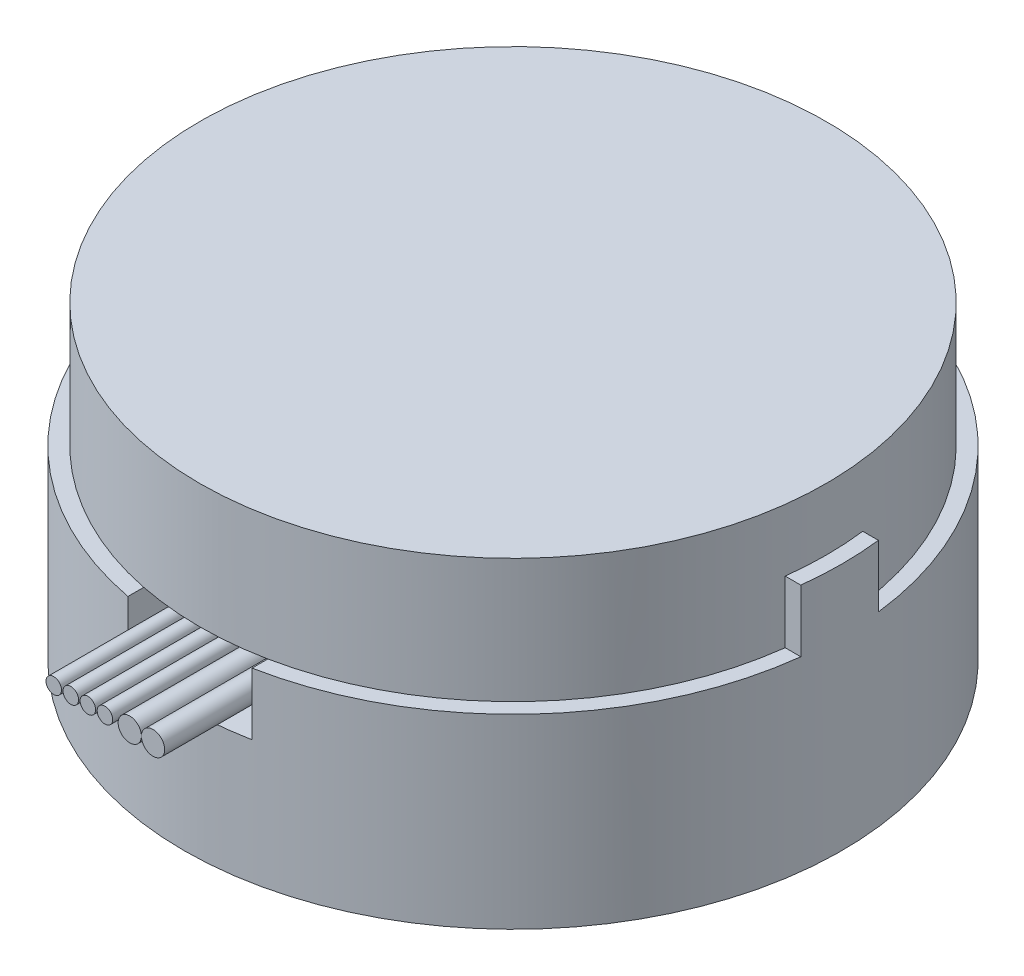
ISO-10303-21;
HEADER;
FILE_DESCRIPTION(('STEP AP214'),'2;1');
FILE_NAME('part.step','',(''),(''),'','','');
FILE_SCHEMA(('AUTOMOTIVE_DESIGN { 1 0 10303 214 1 1 1 1 }'));
ENDSEC;
DATA;
#1=APPLICATION_CONTEXT('core data for automotive mechanical design processes');
#2=APPLICATION_PROTOCOL_DEFINITION('international standard','automotive_design',2000,#1);
#3=PRODUCT_CONTEXT('',#1,'mechanical');
#4=PRODUCT('Part','Part','',(#3));
#5=PRODUCT_RELATED_PRODUCT_CATEGORY('part','',(#4));
#6=PRODUCT_DEFINITION_FORMATION('','',#4);
#7=PRODUCT_DEFINITION_CONTEXT('part definition',#1,'design');
#8=PRODUCT_DEFINITION('design','',#6,#7);
#9=PRODUCT_DEFINITION_SHAPE('','',#8);
#10=(LENGTH_UNIT() NAMED_UNIT(*) SI_UNIT(.MILLI.,.METRE.));
#11=(NAMED_UNIT(*) PLANE_ANGLE_UNIT() SI_UNIT($,.RADIAN.));
#12=(NAMED_UNIT(*) SI_UNIT($,.STERADIAN.) SOLID_ANGLE_UNIT());
#13=UNCERTAINTY_MEASURE_WITH_UNIT(LENGTH_MEASURE(1.E-05),#10,'distance_accuracy_value','');
#14=(GEOMETRIC_REPRESENTATION_CONTEXT(3) GLOBAL_UNCERTAINTY_ASSIGNED_CONTEXT((#13)) GLOBAL_UNIT_ASSIGNED_CONTEXT((#10,
#11,#12)) REPRESENTATION_CONTEXT('',''));
#15=CARTESIAN_POINT('',(0.,0.,0.));
#16=DIRECTION('',(0.,0.,1.));
#17=DIRECTION('',(1.,0.,0.));
#18=AXIS2_PLACEMENT_3D('',#15,#16,#17);
#19=CARTESIAN_POINT('',(1.5,10.0171345321893,26.2));
#20=DIRECTION('',(0.,0.,-1.));
#21=DIRECTION('',(-1.,0.,0.));
#22=AXIS2_PLACEMENT_3D('',#19,#20,#21);
#23=CYLINDRICAL_SURFACE('',#22,0.75);
#24=CARTESIAN_POINT('',(1.5,10.0171345321893,16.2));
#25=DIRECTION('',(0.,0.,1.));
#26=DIRECTION('',(1.,0.,0.));
#27=AXIS2_PLACEMENT_3D('',#24,#25,#26);
#28=CIRCLE('',#27,0.75);
#29=CARTESIAN_POINT('',(2.25,10.0171345321893,16.2));
#30=VERTEX_POINT('',#29);
#31=EDGE_CURVE('E65',#30,#30,#28,.T.);
#32=ORIENTED_EDGE('',*,*,#31,.T.);
#33=EDGE_LOOP('',(#32));
#34=FACE_BOUND('',#33,.T.);
#35=CARTESIAN_POINT('',(1.5,10.0171345321893,26.2));
#36=DIRECTION('',(0.,0.,1.));
#37=DIRECTION('',(1.,0.,0.));
#38=AXIS2_PLACEMENT_3D('',#35,#36,#37);
#39=CIRCLE('',#38,0.75);
#40=CARTESIAN_POINT('',(2.25,10.0171345321893,26.2));
#41=VERTEX_POINT('',#40);
#42=EDGE_CURVE('E13',#41,#41,#39,.T.);
#43=ORIENTED_EDGE('',*,*,#42,.F.);
#44=EDGE_LOOP('',(#43));
#45=FACE_BOUND('',#44,.T.);
#46=ADVANCED_FACE('F62',(#34,#45),#23,.T.);
#47=CARTESIAN_POINT('',(1.5,10.0171345321893,26.2));
#48=DIRECTION('',(0.,0.,1.));
#49=DIRECTION('',(1.,0.,0.));
#50=AXIS2_PLACEMENT_3D('',#47,#48,#49);
#51=PLANE('',#50);
#52=ORIENTED_EDGE('',*,*,#42,.T.);
#53=EDGE_LOOP('',(#52));
#54=FACE_BOUND('',#53,.T.);
#55=ADVANCED_FACE('F78',(#54),#51,.T.);
#56=CARTESIAN_POINT('',(1.5,10.0171345321893,16.2));
#57=DIRECTION('',(0.,0.,1.));
#58=DIRECTION('',(1.,0.,0.));
#59=AXIS2_PLACEMENT_3D('',#56,#57,#58);
#60=PLANE('',#59);
#61=ORIENTED_EDGE('',*,*,#31,.F.);
#62=EDGE_LOOP('',(#61));
#63=FACE_BOUND('',#62,.T.);
#64=ADVANCED_FACE('F76',(#63),#60,.F.);
#65=CLOSED_SHELL('',(#46,#55,#64));
#66=MANIFOLD_SOLID_BREP('B2',#65);
#67=CARTESIAN_POINT('',(3.,10.0171345321893,26.2));
#68=DIRECTION('',(0.,0.,-1.));
#69=DIRECTION('',(-1.,0.,0.));
#70=AXIS2_PLACEMENT_3D('',#67,#68,#69);
#71=CYLINDRICAL_SURFACE('',#70,0.75);
#72=CARTESIAN_POINT('',(3.,10.0171345321893,16.2));
#73=DIRECTION('',(0.,0.,1.));
#74=DIRECTION('',(1.,0.,0.));
#75=AXIS2_PLACEMENT_3D('',#72,#73,#74);
#76=CIRCLE('',#75,0.75);
#77=CARTESIAN_POINT('',(3.75,10.0171345321893,16.2));
#78=VERTEX_POINT('',#77);
#79=EDGE_CURVE('E61',#78,#78,#76,.T.);
#80=ORIENTED_EDGE('',*,*,#79,.T.);
#81=EDGE_LOOP('',(#80));
#82=FACE_BOUND('',#81,.T.);
#83=CARTESIAN_POINT('',(3.,10.0171345321893,26.2));
#84=DIRECTION('',(0.,0.,1.));
#85=DIRECTION('',(1.,0.,0.));
#86=AXIS2_PLACEMENT_3D('',#83,#84,#85);
#87=CIRCLE('',#86,0.75);
#88=CARTESIAN_POINT('',(3.75,10.0171345321893,26.2));
#89=VERTEX_POINT('',#88);
#90=EDGE_CURVE('E114',#89,#89,#87,.T.);
#91=ORIENTED_EDGE('',*,*,#90,.F.);
#92=EDGE_LOOP('',(#91));
#93=FACE_BOUND('',#92,.T.);
#94=ADVANCED_FACE('F110',(#82,#93),#71,.T.);
#95=CARTESIAN_POINT('',(3.,10.0171345321893,26.2));
#96=DIRECTION('',(0.,0.,1.));
#97=DIRECTION('',(1.,0.,0.));
#98=AXIS2_PLACEMENT_3D('',#95,#96,#97);
#99=PLANE('',#98);
#100=ORIENTED_EDGE('',*,*,#90,.T.);
#101=EDGE_LOOP('',(#100));
#102=FACE_BOUND('',#101,.T.);
#103=ADVANCED_FACE('F112',(#102),#99,.T.);
#104=CARTESIAN_POINT('',(3.,10.0171345321893,16.2));
#105=DIRECTION('',(0.,0.,1.));
#106=DIRECTION('',(1.,0.,0.));
#107=AXIS2_PLACEMENT_3D('',#104,#105,#106);
#108=PLANE('',#107);
#109=ORIENTED_EDGE('',*,*,#79,.F.);
#110=EDGE_LOOP('',(#109));
#111=FACE_BOUND('',#110,.T.);
#112=ADVANCED_FACE('F129',(#111),#108,.F.);
#113=CLOSED_SHELL('',(#94,#103,#112));
#114=MANIFOLD_SOLID_BREP('B8',#113);
#115=CARTESIAN_POINT('',(-0.1,10.0171345321893,26.2));
#116=DIRECTION('',(0.,0.,-1.));
#117=DIRECTION('',(-1.,0.,0.));
#118=AXIS2_PLACEMENT_3D('',#115,#116,#117);
#119=CYLINDRICAL_SURFACE('',#118,0.5);
#120=CARTESIAN_POINT('',(-0.1,10.0171345321893,26.2));
#121=DIRECTION('',(0.,0.,1.));
#122=DIRECTION('',(1.,0.,0.));
#123=AXIS2_PLACEMENT_3D('',#120,#121,#122);
#124=CIRCLE('',#123,0.5);
#125=CARTESIAN_POINT('',(0.4,10.0171345321893,26.2));
#126=VERTEX_POINT('',#125);
#127=EDGE_CURVE('E162',#126,#126,#124,.T.);
#128=ORIENTED_EDGE('',*,*,#127,.F.);
#129=EDGE_LOOP('',(#128));
#130=FACE_BOUND('',#129,.T.);
#131=CARTESIAN_POINT('',(-0.1,10.0171345321893,16.2));
#132=DIRECTION('',(0.,0.,1.));
#133=DIRECTION('',(1.,0.,0.));
#134=AXIS2_PLACEMENT_3D('',#131,#132,#133);
#135=CIRCLE('',#134,0.5);
#136=CARTESIAN_POINT('',(0.4,10.0171345321893,16.2));
#137=VERTEX_POINT('',#136);
#138=EDGE_CURVE('E109',#137,#137,#135,.T.);
#139=ORIENTED_EDGE('',*,*,#138,.T.);
#140=EDGE_LOOP('',(#139));
#141=FACE_BOUND('',#140,.T.);
#142=ADVANCED_FACE('F158',(#130,#141),#119,.T.);
#143=CARTESIAN_POINT('',(-0.1,10.0171345321893,26.2));
#144=DIRECTION('',(0.,0.,1.));
#145=DIRECTION('',(1.,0.,0.));
#146=AXIS2_PLACEMENT_3D('',#143,#144,#145);
#147=PLANE('',#146);
#148=ORIENTED_EDGE('',*,*,#127,.T.);
#149=EDGE_LOOP('',(#148));
#150=FACE_BOUND('',#149,.T.);
#151=ADVANCED_FACE('F160',(#150),#147,.T.);
#152=CARTESIAN_POINT('',(-0.1,10.0171345321893,16.2));
#153=DIRECTION('',(0.,0.,1.));
#154=DIRECTION('',(1.,0.,0.));
#155=AXIS2_PLACEMENT_3D('',#152,#153,#154);
#156=PLANE('',#155);
#157=ORIENTED_EDGE('',*,*,#138,.F.);
#158=EDGE_LOOP('',(#157));
#159=FACE_BOUND('',#158,.T.);
#160=ADVANCED_FACE('F177',(#159),#156,.F.);
#161=CLOSED_SHELL('',(#142,#151,#160));
#162=MANIFOLD_SOLID_BREP('B56',#161);
#163=CARTESIAN_POINT('',(-1.2,10.0171345321893,26.2));
#164=DIRECTION('',(0.,0.,-1.));
#165=DIRECTION('',(-1.,0.,0.));
#166=AXIS2_PLACEMENT_3D('',#163,#164,#165);
#167=CYLINDRICAL_SURFACE('',#166,0.5);
#168=CARTESIAN_POINT('',(-1.2,10.0171345321893,26.2));
#169=DIRECTION('',(0.,0.,1.));
#170=DIRECTION('',(1.,0.,0.));
#171=AXIS2_PLACEMENT_3D('',#168,#169,#170);
#172=CIRCLE('',#171,0.5);
#173=CARTESIAN_POINT('',(-0.7,10.0171345321893,26.2));
#174=VERTEX_POINT('',#173);
#175=EDGE_CURVE('E210',#174,#174,#172,.T.);
#176=ORIENTED_EDGE('',*,*,#175,.F.);
#177=EDGE_LOOP('',(#176));
#178=FACE_BOUND('',#177,.T.);
#179=CARTESIAN_POINT('',(-1.2,10.0171345321893,16.2));
#180=DIRECTION('',(0.,0.,1.));
#181=DIRECTION('',(1.,0.,0.));
#182=AXIS2_PLACEMENT_3D('',#179,#180,#181);
#183=CIRCLE('',#182,0.5);
#184=CARTESIAN_POINT('',(-0.7,10.0171345321893,16.2));
#185=VERTEX_POINT('',#184);
#186=EDGE_CURVE('E157',#185,#185,#183,.T.);
#187=ORIENTED_EDGE('',*,*,#186,.T.);
#188=EDGE_LOOP('',(#187));
#189=FACE_BOUND('',#188,.T.);
#190=ADVANCED_FACE('F206',(#178,#189),#167,.T.);
#191=CARTESIAN_POINT('',(-1.2,10.0171345321893,26.2));
#192=DIRECTION('',(0.,0.,1.));
#193=DIRECTION('',(1.,0.,0.));
#194=AXIS2_PLACEMENT_3D('',#191,#192,#193);
#195=PLANE('',#194);
#196=ORIENTED_EDGE('',*,*,#175,.T.);
#197=EDGE_LOOP('',(#196));
#198=FACE_BOUND('',#197,.T.);
#199=ADVANCED_FACE('F208',(#198),#195,.T.);
#200=CARTESIAN_POINT('',(-1.2,10.0171345321893,16.2));
#201=DIRECTION('',(0.,0.,1.));
#202=DIRECTION('',(1.,0.,0.));
#203=AXIS2_PLACEMENT_3D('',#200,#201,#202);
#204=PLANE('',#203);
#205=ORIENTED_EDGE('',*,*,#186,.F.);
#206=EDGE_LOOP('',(#205));
#207=FACE_BOUND('',#206,.T.);
#208=ADVANCED_FACE('F225',(#207),#204,.F.);
#209=CLOSED_SHELL('',(#190,#199,#208));
#210=MANIFOLD_SOLID_BREP('B104',#209);
#211=CARTESIAN_POINT('',(-2.3,10.0171345321893,26.2));
#212=DIRECTION('',(0.,0.,-1.));
#213=DIRECTION('',(-1.,0.,0.));
#214=AXIS2_PLACEMENT_3D('',#211,#212,#213);
#215=CYLINDRICAL_SURFACE('',#214,0.5);
#216=CARTESIAN_POINT('',(-2.3,10.0171345321893,26.2));
#217=DIRECTION('',(0.,0.,1.));
#218=DIRECTION('',(1.,0.,0.));
#219=AXIS2_PLACEMENT_3D('',#216,#217,#218);
#220=CIRCLE('',#219,0.5);
#221=CARTESIAN_POINT('',(-1.8,10.0171345321893,26.2));
#222=VERTEX_POINT('',#221);
#223=EDGE_CURVE('E258',#222,#222,#220,.T.);
#224=ORIENTED_EDGE('',*,*,#223,.F.);
#225=EDGE_LOOP('',(#224));
#226=FACE_BOUND('',#225,.T.);
#227=CARTESIAN_POINT('',(-2.3,10.0171345321893,16.2));
#228=DIRECTION('',(0.,0.,1.));
#229=DIRECTION('',(1.,0.,0.));
#230=AXIS2_PLACEMENT_3D('',#227,#228,#229);
#231=CIRCLE('',#230,0.5);
#232=CARTESIAN_POINT('',(-1.8,10.0171345321893,16.2));
#233=VERTEX_POINT('',#232);
#234=EDGE_CURVE('E205',#233,#233,#231,.T.);
#235=ORIENTED_EDGE('',*,*,#234,.T.);
#236=EDGE_LOOP('',(#235));
#237=FACE_BOUND('',#236,.T.);
#238=ADVANCED_FACE('F254',(#226,#237),#215,.T.);
#239=CARTESIAN_POINT('',(-2.3,10.0171345321893,26.2));
#240=DIRECTION('',(0.,0.,1.));
#241=DIRECTION('',(1.,0.,0.));
#242=AXIS2_PLACEMENT_3D('',#239,#240,#241);
#243=PLANE('',#242);
#244=ORIENTED_EDGE('',*,*,#223,.T.);
#245=EDGE_LOOP('',(#244));
#246=FACE_BOUND('',#245,.T.);
#247=ADVANCED_FACE('F256',(#246),#243,.T.);
#248=CARTESIAN_POINT('',(-2.3,10.0171345321893,16.2));
#249=DIRECTION('',(0.,0.,1.));
#250=DIRECTION('',(1.,0.,0.));
#251=AXIS2_PLACEMENT_3D('',#248,#249,#250);
#252=PLANE('',#251);
#253=ORIENTED_EDGE('',*,*,#234,.F.);
#254=EDGE_LOOP('',(#253));
#255=FACE_BOUND('',#254,.T.);
#256=ADVANCED_FACE('F273',(#255),#252,.F.);
#257=CLOSED_SHELL('',(#238,#247,#256));
#258=MANIFOLD_SOLID_BREP('B152',#257);
#259=CARTESIAN_POINT('',(-3.4,10.0171345321893,26.2));
#260=DIRECTION('',(0.,0.,-1.));
#261=DIRECTION('',(-1.,0.,0.));
#262=AXIS2_PLACEMENT_3D('',#259,#260,#261);
#263=CYLINDRICAL_SURFACE('',#262,0.5);
#264=CARTESIAN_POINT('',(-3.4,10.0171345321893,26.2));
#265=DIRECTION('',(0.,0.,1.));
#266=DIRECTION('',(1.,0.,0.));
#267=AXIS2_PLACEMENT_3D('',#264,#265,#266);
#268=CIRCLE('',#267,0.5);
#269=CARTESIAN_POINT('',(-2.9,10.0171345321893,26.2));
#270=VERTEX_POINT('',#269);
#271=EDGE_CURVE('E253',#270,#270,#268,.T.);
#272=ORIENTED_EDGE('',*,*,#271,.F.);
#273=EDGE_LOOP('',(#272));
#274=FACE_BOUND('',#273,.T.);
#275=CARTESIAN_POINT('',(-3.4,10.0171345321893,16.2));
#276=DIRECTION('',(0.,0.,1.));
#277=DIRECTION('',(1.,0.,0.));
#278=AXIS2_PLACEMENT_3D('',#275,#276,#277);
#279=CIRCLE('',#278,0.5);
#280=CARTESIAN_POINT('',(-2.9,10.0171345321893,16.2));
#281=VERTEX_POINT('',#280);
#282=EDGE_CURVE('E307',#281,#281,#279,.T.);
#283=ORIENTED_EDGE('',*,*,#282,.T.);
#284=EDGE_LOOP('',(#283));
#285=FACE_BOUND('',#284,.T.);
#286=ADVANCED_FACE('F304',(#274,#285),#263,.T.);
#287=CARTESIAN_POINT('',(-3.4,10.0171345321893,26.2));
#288=DIRECTION('',(0.,0.,1.));
#289=DIRECTION('',(1.,0.,0.));
#290=AXIS2_PLACEMENT_3D('',#287,#288,#289);
#291=PLANE('',#290);
#292=ORIENTED_EDGE('',*,*,#271,.T.);
#293=EDGE_LOOP('',(#292));
#294=FACE_BOUND('',#293,.T.);
#295=ADVANCED_FACE('F319',(#294),#291,.T.);
#296=CARTESIAN_POINT('',(-3.4,10.0171345321893,16.2));
#297=DIRECTION('',(0.,0.,1.));
#298=DIRECTION('',(1.,0.,0.));
#299=AXIS2_PLACEMENT_3D('',#296,#297,#298);
#300=PLANE('',#299);
#301=ORIENTED_EDGE('',*,*,#282,.F.);
#302=EDGE_LOOP('',(#301));
#303=FACE_BOUND('',#302,.T.);
#304=ADVANCED_FACE('F317',(#303),#300,.F.);
#305=CLOSED_SHELL('',(#286,#295,#304));
#306=MANIFOLD_SOLID_BREP('B200',#305);
#307=CARTESIAN_POINT('',(0.,12.,0.));
#308=DIRECTION('',(0.,1.,0.));
#309=DIRECTION('',(0.,0.,1.));
#310=AXIS2_PLACEMENT_3D('',#307,#308,#309);
#311=PLANE('',#310);
#312=DIRECTION('',(0.,0.,-1.));
#313=VECTOR('',#312,1.);
#314=CARTESIAN_POINT('',(4.,12.,0.));
#315=LINE('',#314,#313);
#316=CARTESIAN_POINT('',(4.,12.,20.819221887477));
#317=VERTEX_POINT('',#316);
#318=CARTESIAN_POINT('',(4.,12.,19.8));
#319=VERTEX_POINT('',#318);
#320=EDGE_CURVE('E353',#317,#319,#315,.T.);
#321=ORIENTED_EDGE('',*,*,#320,.F.);
#322=CARTESIAN_POINT('',(0.,12.,0.));
#323=DIRECTION('',(0.,1.,0.));
#324=DIRECTION('',(0.,0.,1.));
#325=AXIS2_PLACEMENT_3D('',#322,#323,#324);
#326=CIRCLE('',#325,21.2);
#327=CARTESIAN_POINT('',(21.0520782822029,12.,2.5));
#328=VERTEX_POINT('',#327);
#329=EDGE_CURVE('E534',#317,#328,#326,.T.);
#330=ORIENTED_EDGE('',*,*,#329,.T.);
#331=DIRECTION('',(1.,0.,0.));
#332=VECTOR('',#331,1.);
#333=CARTESIAN_POINT('',(20.0447000476435,12.,2.5));
#334=LINE('',#333,#332);
#335=CARTESIAN_POINT('',(20.0447000476435,12.,2.5));
#336=VERTEX_POINT('',#335);
#337=EDGE_CURVE('E481',#336,#328,#334,.T.);
#338=ORIENTED_EDGE('',*,*,#337,.F.);
#339=CARTESIAN_POINT('',(0.,12.,0.));
#340=DIRECTION('',(0.,1.,0.));
#341=DIRECTION('',(0.,0.,1.));
#342=AXIS2_PLACEMENT_3D('',#339,#340,#341);
#343=CIRCLE('',#342,20.2);
#344=EDGE_CURVE('E483',#319,#336,#343,.T.);
#345=ORIENTED_EDGE('',*,*,#344,.F.);
#346=EDGE_LOOP('',(#321,#330,#338,#345));
#347=FACE_BOUND('',#346,.T.);
#348=ADVANCED_FACE('F345',(#347),#311,.T.);
#349=CARTESIAN_POINT('',(0.,20.,0.));
#350=DIRECTION('',(0.,-1.,0.));
#351=DIRECTION('',(0.,0.,-1.));
#352=AXIS2_PLACEMENT_3D('',#349,#350,#351);
#353=CYLINDRICAL_SURFACE('',#352,21.2);
#354=CARTESIAN_POINT('',(0.,0.,0.));
#355=DIRECTION('',(0.,1.,0.));
#356=DIRECTION('',(0.,0.,1.));
#357=AXIS2_PLACEMENT_3D('',#354,#355,#356);
#358=CIRCLE('',#357,21.2);
#359=CARTESIAN_POINT('',(0.,0.,21.2));
#360=VERTEX_POINT('',#359);
#361=EDGE_CURVE('E531',#360,#360,#358,.T.);
#362=ORIENTED_EDGE('',*,*,#361,.T.);
#363=EDGE_LOOP('',(#362));
#364=FACE_BOUND('',#363,.T.);
#365=ORIENTED_EDGE('',*,*,#329,.F.);
#366=DIRECTION('',(0.,-1.,0.));
#367=VECTOR('',#366,1.);
#368=CARTESIAN_POINT('',(4.,20.,20.819221887477));
#369=LINE('',#368,#367);
#370=CARTESIAN_POINT('',(4.,8.,20.819221887477));
#371=VERTEX_POINT('',#370);
#372=EDGE_CURVE('E475',#317,#371,#369,.T.);
#373=ORIENTED_EDGE('',*,*,#372,.T.);
#374=CARTESIAN_POINT('',(0.,8.,0.));
#375=DIRECTION('',(0.,-1.,0.));
#376=DIRECTION('',(0.,0.,-1.));
#377=AXIS2_PLACEMENT_3D('',#374,#375,#376);
#378=CIRCLE('',#377,21.2);
#379=CARTESIAN_POINT('',(-4.,8.,20.819221887477));
#380=VERTEX_POINT('',#379);
#381=EDGE_CURVE('E302',#371,#380,#378,.T.);
#382=ORIENTED_EDGE('',*,*,#381,.T.);
#383=DIRECTION('',(0.,-1.,0.));
#384=VECTOR('',#383,1.);
#385=CARTESIAN_POINT('',(-4.,20.,20.819221887477));
#386=LINE('',#385,#384);
#387=CARTESIAN_POINT('',(-4.,12.,20.819221887477));
#388=VERTEX_POINT('',#387);
#389=EDGE_CURVE('E468',#380,#388,#386,.F.);
#390=ORIENTED_EDGE('',*,*,#389,.T.);
#391=CARTESIAN_POINT('',(-21.0520782822029,12.,2.5));
#392=VERTEX_POINT('',#391);
#393=EDGE_CURVE('E538',#392,#388,#326,.T.);
#394=ORIENTED_EDGE('',*,*,#393,.F.);
#395=DIRECTION('',(0.,-1.,0.));
#396=VECTOR('',#395,1.);
#397=CARTESIAN_POINT('',(-21.0520782822029,20.,2.5));
#398=LINE('',#397,#396);
#399=CARTESIAN_POINT('',(-21.0520782822029,16.,2.5));
#400=VERTEX_POINT('',#399);
#401=EDGE_CURVE('E521',#400,#392,#398,.T.);
#402=ORIENTED_EDGE('',*,*,#401,.F.);
#403=CARTESIAN_POINT('',(0.,16.,0.));
#404=DIRECTION('',(0.,1.,0.));
#405=DIRECTION('',(0.,0.,1.));
#406=AXIS2_PLACEMENT_3D('',#403,#404,#405);
#407=CIRCLE('',#406,21.2);
#408=CARTESIAN_POINT('',(-21.0520782822029,16.,-2.5));
#409=VERTEX_POINT('',#408);
#410=EDGE_CURVE('E530',#409,#400,#407,.T.);
#411=ORIENTED_EDGE('',*,*,#410,.F.);
#412=DIRECTION('',(0.,-1.,0.));
#413=VECTOR('',#412,1.);
#414=CARTESIAN_POINT('',(-21.0520782822029,20.,-2.5));
#415=LINE('',#414,#413);
#416=CARTESIAN_POINT('',(-21.0520782822029,12.,-2.5));
#417=VERTEX_POINT('',#416);
#418=EDGE_CURVE('E519',#417,#409,#415,.F.);
#419=ORIENTED_EDGE('',*,*,#418,.F.);
#420=CARTESIAN_POINT('',(21.0520782822029,12.,-2.5));
#421=VERTEX_POINT('',#420);
#422=EDGE_CURVE('E541',#421,#417,#326,.T.);
#423=ORIENTED_EDGE('',*,*,#422,.F.);
#424=DIRECTION('',(0.,-1.,0.));
#425=VECTOR('',#424,1.);
#426=CARTESIAN_POINT('',(21.0520782822029,20.,-2.5));
#427=LINE('',#426,#425);
#428=CARTESIAN_POINT('',(21.0520782822029,16.,-2.5));
#429=VERTEX_POINT('',#428);
#430=EDGE_CURVE('E517',#429,#421,#427,.T.);
#431=ORIENTED_EDGE('',*,*,#430,.F.);
#432=CARTESIAN_POINT('',(21.0520782822029,16.,2.5));
#433=VERTEX_POINT('',#432);
#434=EDGE_CURVE('E535',#433,#429,#407,.T.);
#435=ORIENTED_EDGE('',*,*,#434,.F.);
#436=DIRECTION('',(0.,-1.,0.));
#437=VECTOR('',#436,1.);
#438=CARTESIAN_POINT('',(21.0520782822029,20.,2.5));
#439=LINE('',#438,#437);
#440=EDGE_CURVE('E509',#328,#433,#439,.F.);
#441=ORIENTED_EDGE('',*,*,#440,.F.);
#442=EDGE_LOOP('',(#365,#373,#382,#390,#394,#402,#411,#419,#423,#431,#435,#441));
#443=FACE_BOUND('',#442,.T.);
#444=ADVANCED_FACE('F347',(#364,#443),#353,.T.);
#445=CARTESIAN_POINT('',(0.,16.,0.));
#446=DIRECTION('',(0.,1.,0.));
#447=DIRECTION('',(0.,0.,1.));
#448=AXIS2_PLACEMENT_3D('',#445,#446,#447);
#449=PLANE('',#448);
#450=ORIENTED_EDGE('',*,*,#410,.T.);
#451=DIRECTION('',(1.,0.,0.));
#452=VECTOR('',#451,1.);
#453=CARTESIAN_POINT('',(-23.0373390547669,16.,2.5));
#454=LINE('',#453,#452);
#455=CARTESIAN_POINT('',(-20.0447000476435,16.,2.5));
#456=VERTEX_POINT('',#455);
#457=EDGE_CURVE('E504',#400,#456,#454,.T.);
#458=ORIENTED_EDGE('',*,*,#457,.T.);
#459=CARTESIAN_POINT('',(0.,16.,0.));
#460=DIRECTION('',(0.,1.,0.));
#461=DIRECTION('',(0.,0.,1.));
#462=AXIS2_PLACEMENT_3D('',#459,#460,#461);
#463=CIRCLE('',#462,20.2);
#464=CARTESIAN_POINT('',(-20.0447000476435,16.,-2.5));
#465=VERTEX_POINT('',#464);
#466=EDGE_CURVE('E527',#456,#465,#463,.F.);
#467=ORIENTED_EDGE('',*,*,#466,.T.);
#468=DIRECTION('',(-1.,0.,0.));
#469=VECTOR('',#468,1.);
#470=CARTESIAN_POINT('',(-23.0373390547669,16.,-2.5));
#471=LINE('',#470,#469);
#472=EDGE_CURVE('E501',#465,#409,#471,.T.);
#473=ORIENTED_EDGE('',*,*,#472,.T.);
#474=EDGE_LOOP('',(#450,#458,#467,#473));
#475=FACE_BOUND('',#474,.T.);
#476=ADVANCED_FACE('F598',(#475),#449,.T.);
#477=ORIENTED_EDGE('',*,*,#434,.T.);
#478=DIRECTION('',(-1.,0.,0.));
#479=VECTOR('',#478,1.);
#480=CARTESIAN_POINT('',(20.0447000476435,16.,-2.5));
#481=LINE('',#480,#479);
#482=CARTESIAN_POINT('',(20.0447000476435,16.,-2.5));
#483=VERTEX_POINT('',#482);
#484=EDGE_CURVE('E498',#429,#483,#481,.T.);
#485=ORIENTED_EDGE('',*,*,#484,.T.);
#486=CARTESIAN_POINT('',(20.0447000476435,16.,2.5));
#487=VERTEX_POINT('',#486);
#488=EDGE_CURVE('E526',#483,#487,#463,.F.);
#489=ORIENTED_EDGE('',*,*,#488,.T.);
#490=DIRECTION('',(1.,0.,0.));
#491=VECTOR('',#490,1.);
#492=CARTESIAN_POINT('',(20.0447000476435,16.,2.5));
#493=LINE('',#492,#491);
#494=EDGE_CURVE('E368',#487,#433,#493,.T.);
#495=ORIENTED_EDGE('',*,*,#494,.T.);
#496=EDGE_LOOP('',(#477,#485,#489,#495));
#497=FACE_BOUND('',#496,.T.);
#498=ADVANCED_FACE('F557',(#497),#449,.T.);
#499=CARTESIAN_POINT('',(0.,0.,0.));
#500=DIRECTION('',(0.,1.,0.));
#501=DIRECTION('',(0.,0.,1.));
#502=AXIS2_PLACEMENT_3D('',#499,#500,#501);
#503=PLANE('',#502);
#504=ORIENTED_EDGE('',*,*,#361,.F.);
#505=EDGE_LOOP('',(#504));
#506=FACE_BOUND('',#505,.T.);
#507=ADVANCED_FACE('F625',(#506),#503,.F.);
#508=CARTESIAN_POINT('',(0.,-61.5595632530304,0.));
#509=DIRECTION('',(0.,1.,0.));
#510=DIRECTION('',(0.,0.,1.));
#511=AXIS2_PLACEMENT_3D('',#508,#509,#510);
#512=CYLINDRICAL_SURFACE('',#511,20.2);
#513=ORIENTED_EDGE('',*,*,#466,.F.);
#514=DIRECTION('',(0.,1.,0.));
#515=VECTOR('',#514,1.);
#516=CARTESIAN_POINT('',(-20.0447000476435,12.,2.5));
#517=LINE('',#516,#515);
#518=CARTESIAN_POINT('',(-20.0447000476435,12.,2.5));
#519=VERTEX_POINT('',#518);
#520=EDGE_CURVE('E507',#519,#456,#517,.T.);
#521=ORIENTED_EDGE('',*,*,#520,.F.);
#522=CARTESIAN_POINT('',(-4.,12.,19.8));
#523=VERTEX_POINT('',#522);
#524=EDGE_CURVE('E478',#519,#523,#343,.T.);
#525=ORIENTED_EDGE('',*,*,#524,.T.);
#526=EDGE_CURVE('E482',#523,#319,#343,.T.);
#527=ORIENTED_EDGE('',*,*,#526,.T.);
#528=ORIENTED_EDGE('',*,*,#344,.T.);
#529=DIRECTION('',(0.,1.,0.));
#530=VECTOR('',#529,1.);
#531=CARTESIAN_POINT('',(20.0447000476435,12.,2.5));
#532=LINE('',#531,#530);
#533=EDGE_CURVE('E496',#336,#487,#532,.T.);
#534=ORIENTED_EDGE('',*,*,#533,.T.);
#535=ORIENTED_EDGE('',*,*,#488,.F.);
#536=DIRECTION('',(0.,1.,0.));
#537=VECTOR('',#536,1.);
#538=CARTESIAN_POINT('',(20.0447000476435,12.,-2.5));
#539=LINE('',#538,#537);
#540=CARTESIAN_POINT('',(20.0447000476435,12.,-2.5));
#541=VERTEX_POINT('',#540);
#542=EDGE_CURVE('E513',#541,#483,#539,.T.);
#543=ORIENTED_EDGE('',*,*,#542,.F.);
#544=CARTESIAN_POINT('',(0.,12.,0.));
#545=DIRECTION('',(0.,1.,0.));
#546=DIRECTION('',(0.,0.,1.));
#547=AXIS2_PLACEMENT_3D('',#544,#545,#546);
#548=CIRCLE('',#547,20.2);
#549=CARTESIAN_POINT('',(-20.0447000476435,12.,-2.5));
#550=VERTEX_POINT('',#549);
#551=EDGE_CURVE('E488',#541,#550,#548,.T.);
#552=ORIENTED_EDGE('',*,*,#551,.T.);
#553=DIRECTION('',(0.,1.,0.));
#554=VECTOR('',#553,1.);
#555=CARTESIAN_POINT('',(-20.0447000476435,12.,-2.5));
#556=LINE('',#555,#554);
#557=EDGE_CURVE('E510',#550,#465,#556,.T.);
#558=ORIENTED_EDGE('',*,*,#557,.T.);
#559=EDGE_LOOP('',(#513,#521,#525,#527,#528,#534,#535,#543,#552,#558));
#560=FACE_BOUND('',#559,.T.);
#561=CARTESIAN_POINT('',(0.,20.,0.));
#562=DIRECTION('',(0.,1.,0.));
#563=DIRECTION('',(0.,0.,1.));
#564=AXIS2_PLACEMENT_3D('',#561,#562,#563);
#565=CIRCLE('',#564,20.2);
#566=CARTESIAN_POINT('',(0.,20.,20.2));
#567=VERTEX_POINT('',#566);
#568=EDGE_CURVE('E523',#567,#567,#565,.T.);
#569=ORIENTED_EDGE('',*,*,#568,.F.);
#570=EDGE_LOOP('',(#569));
#571=FACE_BOUND('',#570,.T.);
#572=ADVANCED_FACE('F563',(#560,#571),#512,.T.);
#573=CARTESIAN_POINT('',(0.,20.,0.));
#574=DIRECTION('',(0.,1.,0.));
#575=DIRECTION('',(0.,0.,1.));
#576=AXIS2_PLACEMENT_3D('',#573,#574,#575);
#577=PLANE('',#576);
#578=ORIENTED_EDGE('',*,*,#568,.T.);
#579=EDGE_LOOP('',(#578));
#580=FACE_BOUND('',#579,.T.);
#581=ADVANCED_FACE('F614',(#580),#577,.T.);
#582=CARTESIAN_POINT('',(20.0447000476435,12.,2.5));
#583=DIRECTION('',(0.,0.,1.));
#584=DIRECTION('',(1.,0.,0.));
#585=AXIS2_PLACEMENT_3D('',#582,#583,#584);
#586=PLANE('',#585);
#587=ORIENTED_EDGE('',*,*,#440,.T.);
#588=ORIENTED_EDGE('',*,*,#494,.F.);
#589=ORIENTED_EDGE('',*,*,#533,.F.);
#590=ORIENTED_EDGE('',*,*,#337,.T.);
#591=EDGE_LOOP('',(#587,#588,#589,#590));
#592=FACE_BOUND('',#591,.T.);
#593=ADVANCED_FACE('F553',(#592),#586,.T.);
#594=CARTESIAN_POINT('',(-23.0373390547669,12.,2.5));
#595=DIRECTION('',(0.,0.,1.));
#596=DIRECTION('',(1.,0.,0.));
#597=AXIS2_PLACEMENT_3D('',#594,#595,#596);
#598=PLANE('',#597);
#599=ORIENTED_EDGE('',*,*,#401,.T.);
#600=DIRECTION('',(1.,0.,0.));
#601=VECTOR('',#600,1.);
#602=CARTESIAN_POINT('',(-23.0373390547669,12.,2.5));
#603=LINE('',#602,#601);
#604=EDGE_CURVE('E494',#392,#519,#603,.T.);
#605=ORIENTED_EDGE('',*,*,#604,.T.);
#606=ORIENTED_EDGE('',*,*,#520,.T.);
#607=ORIENTED_EDGE('',*,*,#457,.F.);
#608=EDGE_LOOP('',(#599,#605,#606,#607));
#609=FACE_BOUND('',#608,.T.);
#610=ADVANCED_FACE('F603',(#609),#598,.T.);
#611=DIRECTION('',(0.,0.,1.));
#612=VECTOR('',#611,1.);
#613=CARTESIAN_POINT('',(-4.,12.,0.));
#614=LINE('',#613,#612);
#615=EDGE_CURVE('E542',#523,#388,#614,.T.);
#616=ORIENTED_EDGE('',*,*,#615,.F.);
#617=ORIENTED_EDGE('',*,*,#524,.F.);
#618=ORIENTED_EDGE('',*,*,#604,.F.);
#619=ORIENTED_EDGE('',*,*,#393,.T.);
#620=EDGE_LOOP('',(#616,#617,#618,#619));
#621=FACE_BOUND('',#620,.T.);
#622=ADVANCED_FACE('F570',(#621),#311,.T.);
#623=ORIENTED_EDGE('',*,*,#422,.T.);
#624=DIRECTION('',(-1.,0.,0.));
#625=VECTOR('',#624,1.);
#626=CARTESIAN_POINT('',(-23.0373390547669,12.,-2.5));
#627=LINE('',#626,#625);
#628=EDGE_CURVE('E491',#550,#417,#627,.T.);
#629=ORIENTED_EDGE('',*,*,#628,.F.);
#630=ORIENTED_EDGE('',*,*,#551,.F.);
#631=DIRECTION('',(-1.,0.,0.));
#632=VECTOR('',#631,1.);
#633=CARTESIAN_POINT('',(20.0447000476435,12.,-2.5));
#634=LINE('',#633,#632);
#635=EDGE_CURVE('E486',#421,#541,#634,.T.);
#636=ORIENTED_EDGE('',*,*,#635,.F.);
#637=EDGE_LOOP('',(#623,#629,#630,#636));
#638=FACE_BOUND('',#637,.T.);
#639=ADVANCED_FACE('F594',(#638),#311,.T.);
#640=CARTESIAN_POINT('',(-23.0373390547669,12.,-2.5));
#641=DIRECTION('',(0.,0.,-1.));
#642=DIRECTION('',(-1.,0.,0.));
#643=AXIS2_PLACEMENT_3D('',#640,#641,#642);
#644=PLANE('',#643);
#645=ORIENTED_EDGE('',*,*,#418,.T.);
#646=ORIENTED_EDGE('',*,*,#472,.F.);
#647=ORIENTED_EDGE('',*,*,#557,.F.);
#648=ORIENTED_EDGE('',*,*,#628,.T.);
#649=EDGE_LOOP('',(#645,#646,#647,#648));
#650=FACE_BOUND('',#649,.T.);
#651=ADVANCED_FACE('F587',(#650),#644,.T.);
#652=CARTESIAN_POINT('',(20.0447000476435,12.,-2.5));
#653=DIRECTION('',(0.,0.,-1.));
#654=DIRECTION('',(-1.,0.,0.));
#655=AXIS2_PLACEMENT_3D('',#652,#653,#654);
#656=PLANE('',#655);
#657=ORIENTED_EDGE('',*,*,#430,.T.);
#658=ORIENTED_EDGE('',*,*,#635,.T.);
#659=ORIENTED_EDGE('',*,*,#542,.T.);
#660=ORIENTED_EDGE('',*,*,#484,.F.);
#661=EDGE_LOOP('',(#657,#658,#659,#660));
#662=FACE_BOUND('',#661,.T.);
#663=ADVANCED_FACE('F580',(#662),#656,.T.);
#664=CARTESIAN_POINT('',(-4.,8.,16.2));
#665=DIRECTION('',(0.,-1.,0.));
#666=DIRECTION('',(0.,0.,-1.));
#667=AXIS2_PLACEMENT_3D('',#664,#665,#666);
#668=PLANE('',#667);
#669=DIRECTION('',(0.,0.,1.));
#670=VECTOR('',#669,1.);
#671=CARTESIAN_POINT('',(4.,8.,16.2));
#672=LINE('',#671,#670);
#673=CARTESIAN_POINT('',(4.,8.,16.2));
#674=VERTEX_POINT('',#673);
#675=EDGE_CURVE('E466',#674,#371,#672,.T.);
#676=ORIENTED_EDGE('',*,*,#675,.F.);
#677=DIRECTION('',(1.,0.,0.));
#678=VECTOR('',#677,1.);
#679=CARTESIAN_POINT('',(-4.,8.,16.2));
#680=LINE('',#679,#678);
#681=CARTESIAN_POINT('',(-4.,8.,16.2));
#682=VERTEX_POINT('',#681);
#683=EDGE_CURVE('E451',#682,#674,#680,.T.);
#684=ORIENTED_EDGE('',*,*,#683,.F.);
#685=DIRECTION('',(0.,0.,1.));
#686=VECTOR('',#685,1.);
#687=CARTESIAN_POINT('',(-4.,8.,16.2));
#688=LINE('',#687,#686);
#689=EDGE_CURVE('E469',#682,#380,#688,.T.);
#690=ORIENTED_EDGE('',*,*,#689,.T.);
#691=ORIENTED_EDGE('',*,*,#381,.F.);
#692=EDGE_LOOP('',(#676,#684,#690,#691));
#693=FACE_BOUND('',#692,.T.);
#694=ADVANCED_FACE('F578',(#693),#668,.F.);
#695=CARTESIAN_POINT('',(4.,12.,16.2));
#696=DIRECTION('',(1.,0.,0.));
#697=DIRECTION('',(0.,0.,-1.));
#698=AXIS2_PLACEMENT_3D('',#695,#696,#697);
#699=PLANE('',#698);
#700=ORIENTED_EDGE('',*,*,#320,.T.);
#701=DIRECTION('',(0.,0.,1.));
#702=VECTOR('',#701,1.);
#703=CARTESIAN_POINT('',(4.,12.,16.2));
#704=LINE('',#703,#702);
#705=CARTESIAN_POINT('',(4.,12.,16.2));
#706=VERTEX_POINT('',#705);
#707=EDGE_CURVE('E441',#706,#319,#704,.T.);
#708=ORIENTED_EDGE('',*,*,#707,.F.);
#709=DIRECTION('',(0.,1.,0.));
#710=VECTOR('',#709,1.);
#711=CARTESIAN_POINT('',(4.,12.,16.2));
#712=LINE('',#711,#710);
#713=EDGE_CURVE('E446',#674,#706,#712,.T.);
#714=ORIENTED_EDGE('',*,*,#713,.F.);
#715=ORIENTED_EDGE('',*,*,#675,.T.);
#716=ORIENTED_EDGE('',*,*,#372,.F.);
#717=EDGE_LOOP('',(#700,#708,#714,#715,#716));
#718=FACE_BOUND('',#717,.T.);
#719=ADVANCED_FACE('F443',(#718),#699,.F.);
#720=CARTESIAN_POINT('',(-4.,12.,16.2));
#721=DIRECTION('',(-1.,0.,0.));
#722=DIRECTION('',(0.,0.,1.));
#723=AXIS2_PLACEMENT_3D('',#720,#721,#722);
#724=PLANE('',#723);
#725=ORIENTED_EDGE('',*,*,#689,.F.);
#726=DIRECTION('',(0.,-1.,0.));
#727=VECTOR('',#726,1.);
#728=CARTESIAN_POINT('',(-4.,12.,16.2));
#729=LINE('',#728,#727);
#730=CARTESIAN_POINT('',(-4.,12.,16.2));
#731=VERTEX_POINT('',#730);
#732=EDGE_CURVE('E458',#731,#682,#729,.T.);
#733=ORIENTED_EDGE('',*,*,#732,.F.);
#734=DIRECTION('',(0.,0.,1.));
#735=VECTOR('',#734,1.);
#736=CARTESIAN_POINT('',(-4.,12.,16.2));
#737=LINE('',#736,#735);
#738=EDGE_CURVE('E360',#731,#523,#737,.T.);
#739=ORIENTED_EDGE('',*,*,#738,.T.);
#740=ORIENTED_EDGE('',*,*,#615,.T.);
#741=ORIENTED_EDGE('',*,*,#389,.F.);
#742=EDGE_LOOP('',(#725,#733,#739,#740,#741));
#743=FACE_BOUND('',#742,.T.);
#744=ADVANCED_FACE('F576',(#743),#724,.F.);
#745=CARTESIAN_POINT('',(-4.,12.,16.2));
#746=DIRECTION('',(0.,1.,0.));
#747=DIRECTION('',(0.,0.,1.));
#748=AXIS2_PLACEMENT_3D('',#745,#746,#747);
#749=PLANE('',#748);
#750=ORIENTED_EDGE('',*,*,#526,.F.);
#751=ORIENTED_EDGE('',*,*,#738,.F.);
#752=DIRECTION('',(-1.,0.,0.));
#753=VECTOR('',#752,1.);
#754=CARTESIAN_POINT('',(-4.,12.,16.2));
#755=LINE('',#754,#753);
#756=EDGE_CURVE('E454',#706,#731,#755,.T.);
#757=ORIENTED_EDGE('',*,*,#756,.F.);
#758=ORIENTED_EDGE('',*,*,#707,.T.);
#759=EDGE_LOOP('',(#750,#751,#757,#758));
#760=FACE_BOUND('',#759,.T.);
#761=ADVANCED_FACE('F455',(#760),#749,.F.);
#762=CARTESIAN_POINT('',(0.,0.,16.2));
#763=DIRECTION('',(0.,0.,1.));
#764=DIRECTION('',(1.,0.,0.));
#765=AXIS2_PLACEMENT_3D('',#762,#763,#764);
#766=PLANE('',#765);
#767=ORIENTED_EDGE('',*,*,#713,.T.);
#768=ORIENTED_EDGE('',*,*,#756,.T.);
#769=ORIENTED_EDGE('',*,*,#732,.T.);
#770=ORIENTED_EDGE('',*,*,#683,.T.);
#771=EDGE_LOOP('',(#767,#768,#769,#770));
#772=FACE_BOUND('',#771,.T.);
#773=ADVANCED_FACE('F460',(#772),#766,.T.);
#774=CLOSED_SHELL('',(#348,#444,#476,#498,#507,#572,#581,#593,#610,#622,#639,#651,#663,#694,
#719,#744,#761,#773));
#775=MANIFOLD_SOLID_BREP('B248',#774);
#776=ADVANCED_BREP_SHAPE_REPRESENTATION('',(#18,#66,#114,#162,#210,#258,#306,#775),#14);
#777=SHAPE_DEFINITION_REPRESENTATION(#9,#776);
ENDSEC;
END-ISO-10303-21;
